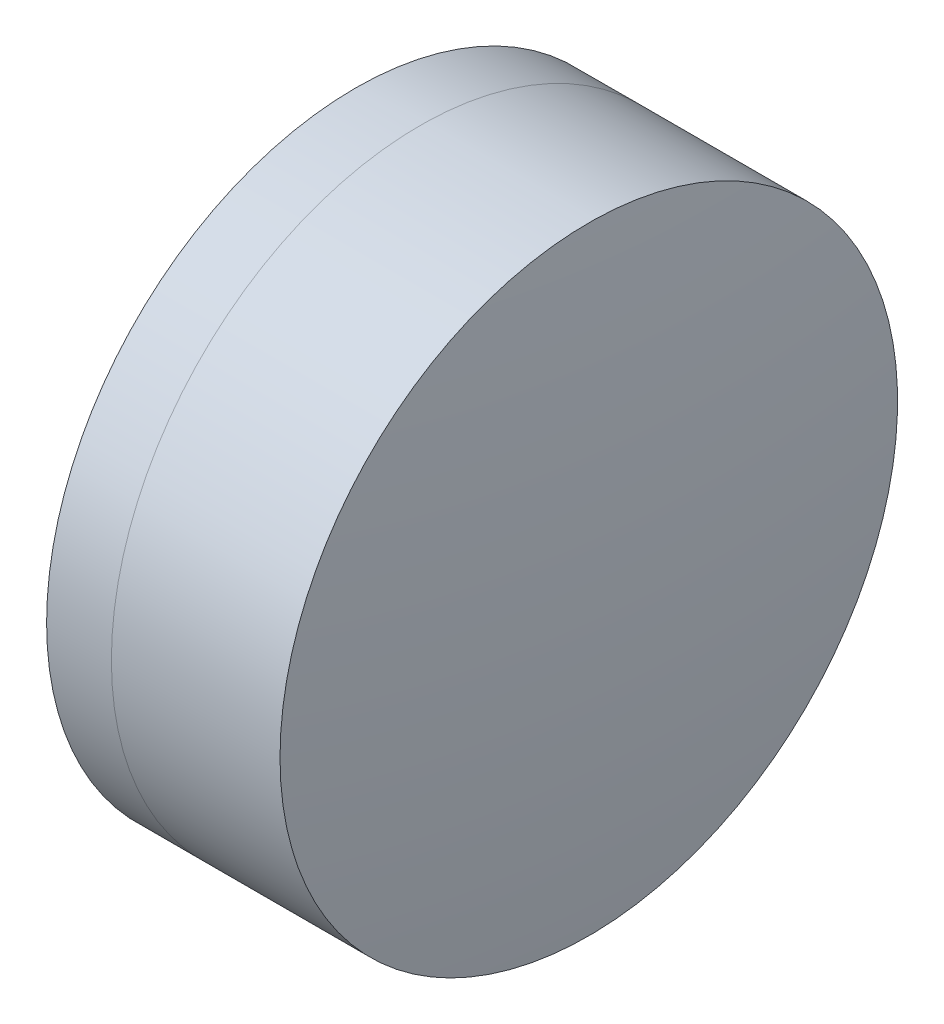
ISO-10303-21;
HEADER;
FILE_DESCRIPTION(('STEP AP214'),'2;1');
FILE_NAME('part.step','',(''),(''),'','','');
FILE_SCHEMA(('AUTOMOTIVE_DESIGN { 1 0 10303 214 1 1 1 1 }'));
ENDSEC;
DATA;
#1=APPLICATION_CONTEXT('core data for automotive mechanical design processes');
#2=APPLICATION_PROTOCOL_DEFINITION('international standard','automotive_design',2000,#1);
#3=PRODUCT_CONTEXT('',#1,'mechanical');
#4=PRODUCT('Part','Part','',(#3));
#5=PRODUCT_RELATED_PRODUCT_CATEGORY('part','',(#4));
#6=PRODUCT_DEFINITION_FORMATION('','',#4);
#7=PRODUCT_DEFINITION_CONTEXT('part definition',#1,'design');
#8=PRODUCT_DEFINITION('design','',#6,#7);
#9=PRODUCT_DEFINITION_SHAPE('','',#8);
#10=(LENGTH_UNIT() NAMED_UNIT(*) SI_UNIT(.MILLI.,.METRE.));
#11=(NAMED_UNIT(*) PLANE_ANGLE_UNIT() SI_UNIT($,.RADIAN.));
#12=(NAMED_UNIT(*) SI_UNIT($,.STERADIAN.) SOLID_ANGLE_UNIT());
#13=UNCERTAINTY_MEASURE_WITH_UNIT(LENGTH_MEASURE(1.E-05),#10,'distance_accuracy_value','');
#14=(GEOMETRIC_REPRESENTATION_CONTEXT(3) GLOBAL_UNCERTAINTY_ASSIGNED_CONTEXT((#13)) GLOBAL_UNIT_ASSIGNED_CONTEXT((#10,
#11,#12)) REPRESENTATION_CONTEXT('',''));
#15=CARTESIAN_POINT('',(0.,0.,0.));
#16=DIRECTION('',(0.,0.,1.));
#17=DIRECTION('',(1.,0.,0.));
#18=AXIS2_PLACEMENT_3D('',#15,#16,#17);
#19=CARTESIAN_POINT('',(-6.62917567080411,0.,0.));
#20=DIRECTION('',(-1.,0.,0.));
#21=DIRECTION('',(0.,0.,1.));
#22=AXIS2_PLACEMENT_3D('',#19,#20,#21);
#23=SPHERICAL_SURFACE('',#22,9.2);
#24=CARTESIAN_POINT('',(1.65575040007908,0.,0.));
#25=DIRECTION('',(-1.,0.,0.));
#26=DIRECTION('',(0.,0.,1.));
#27=AXIS2_PLACEMENT_3D('',#24,#25,#26);
#28=CIRCLE('',#27,4.);
#29=CARTESIAN_POINT('',(1.65575040007908,0.,4.));
#30=VERTEX_POINT('',#29);
#31=EDGE_CURVE('E11',#30,#30,#28,.T.);
#32=ORIENTED_EDGE('',*,*,#31,.T.);
#33=EDGE_LOOP('',(#32));
#34=FACE_BOUND('',#33,.T.);
#35=ADVANCED_FACE('F45',(#34),#23,.F.);
#36=CARTESIAN_POINT('',(-0.551919992657797,0.,0.));
#37=DIRECTION('',(-1.,0.,0.));
#38=DIRECTION('',(0.,0.,1.));
#39=AXIS2_PLACEMENT_3D('',#36,#37,#38);
#40=CYLINDRICAL_SURFACE('',#39,4.);
#41=CARTESIAN_POINT('',(3.84017491609584,0.,0.));
#42=DIRECTION('',(-1.,0.,0.));
#43=DIRECTION('',(0.,0.,1.));
#44=AXIS2_PLACEMENT_3D('',#41,#42,#43);
#45=CIRCLE('',#44,4.);
#46=CARTESIAN_POINT('',(3.84017491609584,0.,4.));
#47=VERTEX_POINT('',#46);
#48=EDGE_CURVE('E51',#47,#47,#45,.T.);
#49=ORIENTED_EDGE('',*,*,#48,.T.);
#50=EDGE_LOOP('',(#49));
#51=FACE_BOUND('',#50,.T.);
#52=ORIENTED_EDGE('',*,*,#31,.F.);
#53=EDGE_LOOP('',(#52));
#54=FACE_BOUND('',#53,.T.);
#55=ADVANCED_FACE('F57',(#51,#54),#40,.T.);
#56=CARTESIAN_POINT('',(-30.7291756708041,0.,0.));
#57=DIRECTION('',(-1.,0.,0.));
#58=DIRECTION('',(0.,0.,1.));
#59=AXIS2_PLACEMENT_3D('',#56,#57,#58);
#60=SPHERICAL_SURFACE('',#59,34.8);
#61=ORIENTED_EDGE('',*,*,#48,.F.);
#62=EDGE_LOOP('',(#61));
#63=FACE_BOUND('',#62,.T.);
#64=ADVANCED_FACE('F60',(#63),#60,.T.);
#65=CLOSED_SHELL('',(#35,#55,#64));
#66=MANIFOLD_SOLID_BREP('B2',#65);
#67=CARTESIAN_POINT('',(11.1708243291959,0.,0.));
#68=DIRECTION('',(-1.,0.,0.));
#69=DIRECTION('',(0.,0.,-1.));
#70=AXIS2_PLACEMENT_3D('',#67,#68,#69);
#71=SPHERICAL_SURFACE('',#70,11.1);
#72=CARTESIAN_POINT('',(0.816598138890788,0.,0.));
#73=DIRECTION('',(-1.,0.,0.));
#74=DIRECTION('',(0.,0.,1.));
#75=AXIS2_PLACEMENT_3D('',#72,#73,#74);
#76=CIRCLE('',#75,4.);
#77=CARTESIAN_POINT('',(0.816598138890788,0.,4.));
#78=VERTEX_POINT('',#77);
#79=EDGE_CURVE('E44',#78,#78,#76,.T.);
#80=ORIENTED_EDGE('',*,*,#79,.T.);
#81=EDGE_LOOP('',(#80));
#82=FACE_BOUND('',#81,.T.);
#83=ADVANCED_FACE('F86',(#82),#71,.T.);
#84=CARTESIAN_POINT('',(-9.70261217833668,0.,0.));
#85=DIRECTION('',(-1.,0.,0.));
#86=DIRECTION('',(0.,0.,1.));
#87=AXIS2_PLACEMENT_3D('',#84,#85,#86);
#88=CYLINDRICAL_SURFACE('',#87,4.);
#89=CARTESIAN_POINT('',(1.65575040007908,0.,0.));
#90=DIRECTION('',(-1.,0.,0.));
#91=DIRECTION('',(0.,0.,1.));
#92=AXIS2_PLACEMENT_3D('',#89,#90,#91);
#93=CIRCLE('',#92,4.);
#94=CARTESIAN_POINT('',(1.65575040007908,0.,4.));
#95=VERTEX_POINT('',#94);
#96=EDGE_CURVE('E92',#95,#95,#93,.T.);
#97=ORIENTED_EDGE('',*,*,#96,.T.);
#98=EDGE_LOOP('',(#97));
#99=FACE_BOUND('',#98,.T.);
#100=ORIENTED_EDGE('',*,*,#79,.F.);
#101=EDGE_LOOP('',(#100));
#102=FACE_BOUND('',#101,.T.);
#103=ADVANCED_FACE('F98',(#99,#102),#88,.T.);
#104=CARTESIAN_POINT('',(-6.62917567080411,0.,0.));
#105=DIRECTION('',(-1.,0.,0.));
#106=DIRECTION('',(0.,0.,1.));
#107=AXIS2_PLACEMENT_3D('',#104,#105,#106);
#108=SPHERICAL_SURFACE('',#107,9.2);
#109=ORIENTED_EDGE('',*,*,#96,.F.);
#110=EDGE_LOOP('',(#109));
#111=FACE_BOUND('',#110,.T.);
#112=ADVANCED_FACE('F101',(#111),#108,.T.);
#113=CLOSED_SHELL('',(#83,#103,#112));
#114=MANIFOLD_SOLID_BREP('B6',#113);
#115=ADVANCED_BREP_SHAPE_REPRESENTATION('',(#18,#66,#114),#14);
#116=SHAPE_DEFINITION_REPRESENTATION(#9,#115);
ENDSEC;
END-ISO-10303-21;
